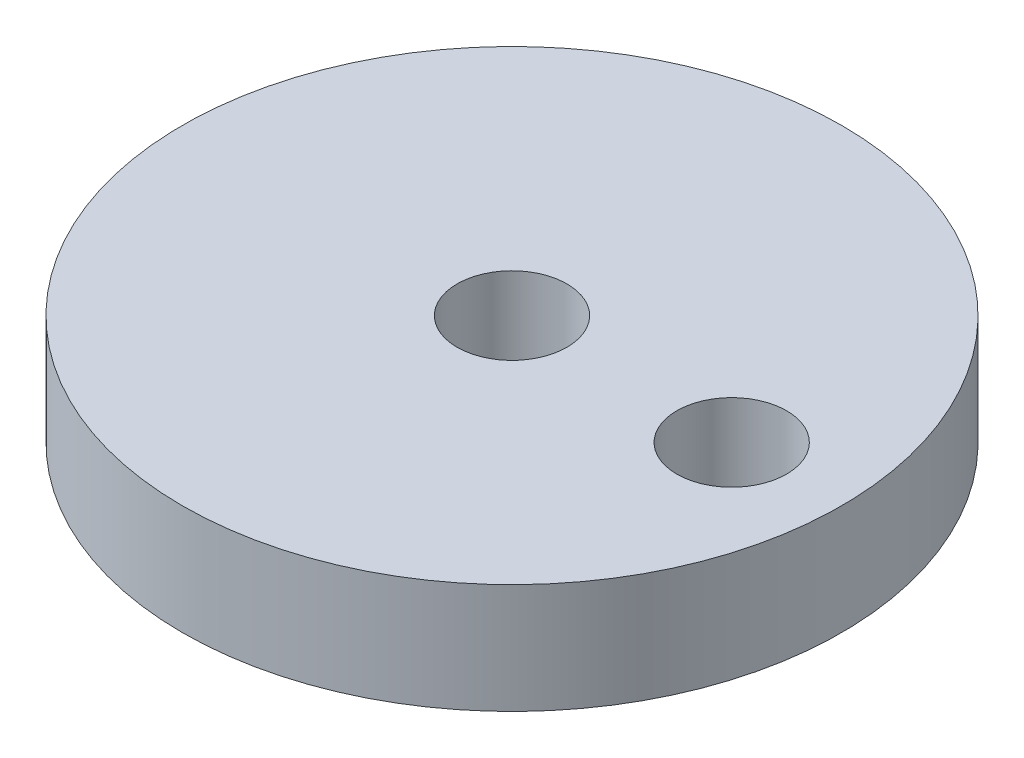
ISO-10303-21;
HEADER;
FILE_DESCRIPTION(('STEP AP214'),'2;1');
FILE_NAME('part.step','',(''),(''),'','','');
FILE_SCHEMA(('AUTOMOTIVE_DESIGN { 1 0 10303 214 1 1 1 1 }'));
ENDSEC;
DATA;
#1=APPLICATION_CONTEXT('core data for automotive mechanical design processes');
#2=APPLICATION_PROTOCOL_DEFINITION('international standard','automotive_design',2000,#1);
#3=PRODUCT_CONTEXT('',#1,'mechanical');
#4=PRODUCT('Part','Part','',(#3));
#5=PRODUCT_RELATED_PRODUCT_CATEGORY('part','',(#4));
#6=PRODUCT_DEFINITION_FORMATION('','',#4);
#7=PRODUCT_DEFINITION_CONTEXT('part definition',#1,'design');
#8=PRODUCT_DEFINITION('design','',#6,#7);
#9=PRODUCT_DEFINITION_SHAPE('','',#8);
#10=(LENGTH_UNIT() NAMED_UNIT(*) SI_UNIT(.MILLI.,.METRE.));
#11=(NAMED_UNIT(*) PLANE_ANGLE_UNIT() SI_UNIT($,.RADIAN.));
#12=(NAMED_UNIT(*) SI_UNIT($,.STERADIAN.) SOLID_ANGLE_UNIT());
#13=UNCERTAINTY_MEASURE_WITH_UNIT(LENGTH_MEASURE(1.E-05),#10,'distance_accuracy_value','');
#14=(GEOMETRIC_REPRESENTATION_CONTEXT(3) GLOBAL_UNCERTAINTY_ASSIGNED_CONTEXT((#13)) GLOBAL_UNIT_ASSIGNED_CONTEXT((#10,
#11,#12)) REPRESENTATION_CONTEXT('',''));
#15=CARTESIAN_POINT('',(0.,0.,0.));
#16=DIRECTION('',(0.,0.,1.));
#17=DIRECTION('',(1.,0.,0.));
#18=AXIS2_PLACEMENT_3D('',#15,#16,#17);
#19=CARTESIAN_POINT('',(0.,10.,0.));
#20=DIRECTION('',(0.,1.,0.));
#21=DIRECTION('',(0.,0.,1.));
#22=AXIS2_PLACEMENT_3D('',#19,#20,#21);
#23=PLANE('',#22);
#24=CARTESIAN_POINT('',(0.,10.,0.));
#25=DIRECTION('',(0.,1.,0.));
#26=DIRECTION('',(0.,0.,1.));
#27=AXIS2_PLACEMENT_3D('',#24,#25,#26);
#28=CIRCLE('',#27,5.);
#29=CARTESIAN_POINT('',(0.,10.,5.));
#30=VERTEX_POINT('',#29);
#31=EDGE_CURVE('E42',#30,#30,#28,.T.);
#32=ORIENTED_EDGE('',*,*,#31,.F.);
#33=EDGE_LOOP('',(#32));
#34=FACE_BOUND('',#33,.T.);
#35=CARTESIAN_POINT('',(0.,10.,0.));
#36=DIRECTION('',(0.,1.,0.));
#37=DIRECTION('',(0.,0.,1.));
#38=AXIS2_PLACEMENT_3D('',#35,#36,#37);
#39=CIRCLE('',#38,30.);
#40=CARTESIAN_POINT('',(0.,10.,30.));
#41=VERTEX_POINT('',#40);
#42=EDGE_CURVE('E10',#41,#41,#39,.T.);
#43=ORIENTED_EDGE('',*,*,#42,.T.);
#44=EDGE_LOOP('',(#43));
#45=FACE_BOUND('',#44,.T.);
#46=CARTESIAN_POINT('',(20.,10.,0.));
#47=DIRECTION('',(0.,1.,0.));
#48=DIRECTION('',(0.,0.,1.));
#49=AXIS2_PLACEMENT_3D('',#46,#47,#48);
#50=CIRCLE('',#49,5.);
#51=CARTESIAN_POINT('',(20.,10.,5.));
#52=VERTEX_POINT('',#51);
#53=EDGE_CURVE('E47',#52,#52,#50,.T.);
#54=ORIENTED_EDGE('',*,*,#53,.F.);
#55=EDGE_LOOP('',(#54));
#56=FACE_BOUND('',#55,.T.);
#57=ADVANCED_FACE('F31',(#34,#45,#56),#23,.T.);
#58=CARTESIAN_POINT('',(0.,0.,0.));
#59=DIRECTION('',(0.,1.,0.));
#60=DIRECTION('',(0.,0.,1.));
#61=AXIS2_PLACEMENT_3D('',#58,#59,#60);
#62=PLANE('',#61);
#63=CARTESIAN_POINT('',(0.,0.,0.));
#64=DIRECTION('',(0.,1.,0.));
#65=DIRECTION('',(0.,0.,1.));
#66=AXIS2_PLACEMENT_3D('',#63,#64,#65);
#67=CIRCLE('',#66,5.);
#68=CARTESIAN_POINT('',(0.,0.,5.));
#69=VERTEX_POINT('',#68);
#70=EDGE_CURVE('E44',#69,#69,#67,.T.);
#71=ORIENTED_EDGE('',*,*,#70,.T.);
#72=EDGE_LOOP('',(#71));
#73=FACE_BOUND('',#72,.T.);
#74=CARTESIAN_POINT('',(0.,0.,0.));
#75=DIRECTION('',(0.,1.,0.));
#76=DIRECTION('',(0.,0.,1.));
#77=AXIS2_PLACEMENT_3D('',#74,#75,#76);
#78=CIRCLE('',#77,30.);
#79=CARTESIAN_POINT('',(0.,0.,30.));
#80=VERTEX_POINT('',#79);
#81=EDGE_CURVE('E35',#80,#80,#78,.T.);
#82=ORIENTED_EDGE('',*,*,#81,.F.);
#83=EDGE_LOOP('',(#82));
#84=FACE_BOUND('',#83,.T.);
#85=CARTESIAN_POINT('',(20.,0.,0.));
#86=DIRECTION('',(0.,1.,0.));
#87=DIRECTION('',(0.,0.,1.));
#88=AXIS2_PLACEMENT_3D('',#85,#86,#87);
#89=CIRCLE('',#88,5.);
#90=CARTESIAN_POINT('',(20.,0.,5.));
#91=VERTEX_POINT('',#90);
#92=EDGE_CURVE('E50',#91,#91,#89,.T.);
#93=ORIENTED_EDGE('',*,*,#92,.T.);
#94=EDGE_LOOP('',(#93));
#95=FACE_BOUND('',#94,.T.);
#96=ADVANCED_FACE('F60',(#73,#84,#95),#62,.F.);
#97=CARTESIAN_POINT('',(0.,10.,0.));
#98=DIRECTION('',(0.,-1.,0.));
#99=DIRECTION('',(0.,0.,-1.));
#100=AXIS2_PLACEMENT_3D('',#97,#98,#99);
#101=CYLINDRICAL_SURFACE('',#100,30.);
#102=ORIENTED_EDGE('',*,*,#42,.F.);
#103=EDGE_LOOP('',(#102));
#104=FACE_BOUND('',#103,.T.);
#105=ORIENTED_EDGE('',*,*,#81,.T.);
#106=EDGE_LOOP('',(#105));
#107=FACE_BOUND('',#106,.T.);
#108=ADVANCED_FACE('F33',(#104,#107),#101,.T.);
#109=CARTESIAN_POINT('',(0.,10.,0.));
#110=DIRECTION('',(0.,-1.,0.));
#111=DIRECTION('',(0.,0.,-1.));
#112=AXIS2_PLACEMENT_3D('',#109,#110,#111);
#113=CYLINDRICAL_SURFACE('',#112,5.);
#114=ORIENTED_EDGE('',*,*,#31,.T.);
#115=EDGE_LOOP('',(#114));
#116=FACE_BOUND('',#115,.T.);
#117=ORIENTED_EDGE('',*,*,#70,.F.);
#118=EDGE_LOOP('',(#117));
#119=FACE_BOUND('',#118,.T.);
#120=ADVANCED_FACE('F69',(#116,#119),#113,.F.);
#121=CARTESIAN_POINT('',(20.,10.,0.));
#122=DIRECTION('',(0.,-1.,0.));
#123=DIRECTION('',(0.,0.,-1.));
#124=AXIS2_PLACEMENT_3D('',#121,#122,#123);
#125=CYLINDRICAL_SURFACE('',#124,5.);
#126=ORIENTED_EDGE('',*,*,#53,.T.);
#127=EDGE_LOOP('',(#126));
#128=FACE_BOUND('',#127,.T.);
#129=ORIENTED_EDGE('',*,*,#92,.F.);
#130=EDGE_LOOP('',(#129));
#131=FACE_BOUND('',#130,.T.);
#132=ADVANCED_FACE('F56',(#128,#131),#125,.F.);
#133=CLOSED_SHELL('',(#57,#96,#108,#120,#132));
#134=MANIFOLD_SOLID_BREP('B2',#133);
#135=ADVANCED_BREP_SHAPE_REPRESENTATION('',(#18,#134),#14);
#136=SHAPE_DEFINITION_REPRESENTATION(#9,#135);
ENDSEC;
END-ISO-10303-21;
